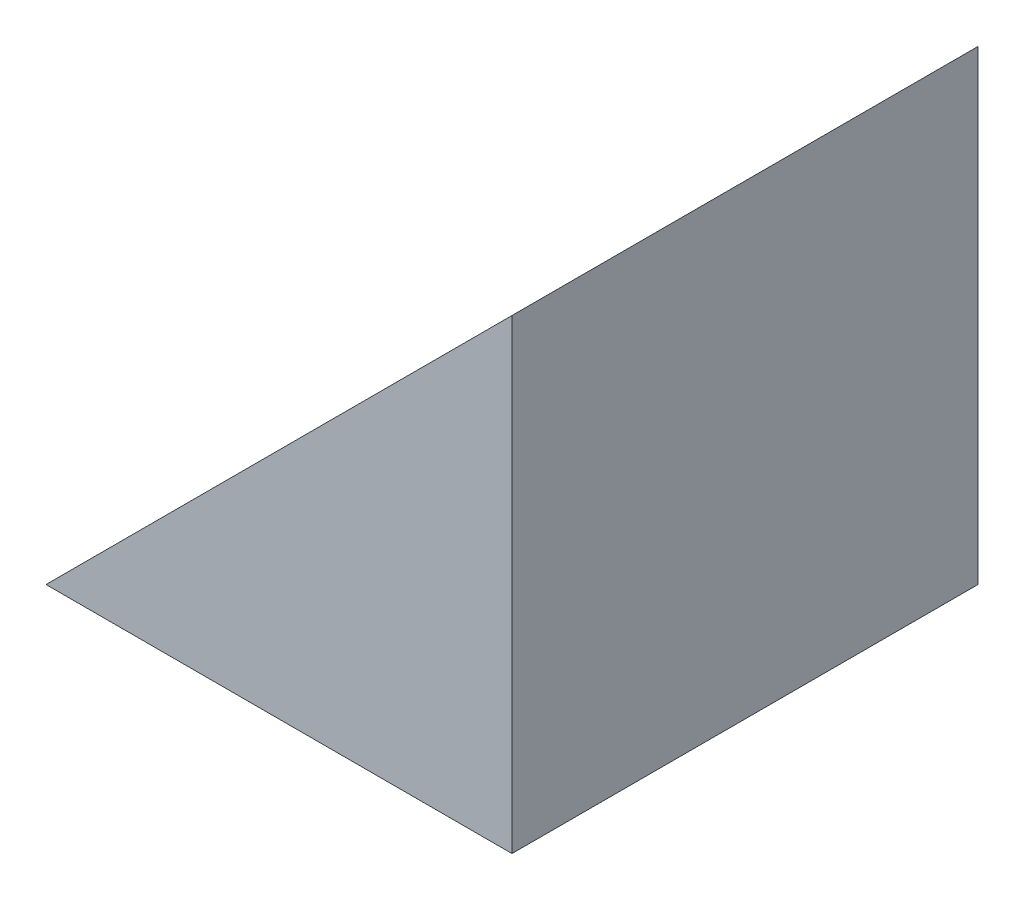
ISO-10303-21;
HEADER;
FILE_DESCRIPTION(('STEP AP214'),'2;1');
FILE_NAME('part.step','',(''),(''),'','','');
FILE_SCHEMA(('AUTOMOTIVE_DESIGN { 1 0 10303 214 1 1 1 1 }'));
ENDSEC;
DATA;
#1=APPLICATION_CONTEXT('core data for automotive mechanical design processes');
#2=APPLICATION_PROTOCOL_DEFINITION('international standard','automotive_design',2000,#1);
#3=PRODUCT_CONTEXT('',#1,'mechanical');
#4=PRODUCT('Part','Part','',(#3));
#5=PRODUCT_RELATED_PRODUCT_CATEGORY('part','',(#4));
#6=PRODUCT_DEFINITION_FORMATION('','',#4);
#7=PRODUCT_DEFINITION_CONTEXT('part definition',#1,'design');
#8=PRODUCT_DEFINITION('design','',#6,#7);
#9=PRODUCT_DEFINITION_SHAPE('','',#8);
#10=(LENGTH_UNIT() NAMED_UNIT(*) SI_UNIT(.MILLI.,.METRE.));
#11=(NAMED_UNIT(*) PLANE_ANGLE_UNIT() SI_UNIT($,.RADIAN.));
#12=(NAMED_UNIT(*) SI_UNIT($,.STERADIAN.) SOLID_ANGLE_UNIT());
#13=UNCERTAINTY_MEASURE_WITH_UNIT(LENGTH_MEASURE(1.E-05),#10,'distance_accuracy_value','');
#14=(GEOMETRIC_REPRESENTATION_CONTEXT(3) GLOBAL_UNCERTAINTY_ASSIGNED_CONTEXT((#13)) GLOBAL_UNIT_ASSIGNED_CONTEXT((#10,
#11,#12)) REPRESENTATION_CONTEXT('',''));
#15=CARTESIAN_POINT('',(0.,0.,0.));
#16=DIRECTION('',(0.,0.,1.));
#17=DIRECTION('',(1.,0.,0.));
#18=AXIS2_PLACEMENT_3D('',#15,#16,#17);
#19=CARTESIAN_POINT('',(17.4714063710906,13.2779070240306,5.));
#20=DIRECTION('',(0.,1.,0.));
#21=DIRECTION('',(0.,0.,1.));
#22=AXIS2_PLACEMENT_3D('',#19,#20,#21);
#23=PLANE('',#22);
#24=DIRECTION('',(1.,0.,0.));
#25=VECTOR('',#24,1.);
#26=CARTESIAN_POINT('',(17.4714063710906,13.2779070240306,0.));
#27=LINE('',#26,#25);
#28=CARTESIAN_POINT('',(12.4714063710906,13.2779070240306,0.));
#29=VERTEX_POINT('',#28);
#30=CARTESIAN_POINT('',(17.4714063710906,13.2779070240306,0.));
#31=VERTEX_POINT('',#30);
#32=EDGE_CURVE('E82',#29,#31,#27,.T.);
#33=ORIENTED_EDGE('',*,*,#32,.T.);
#34=DIRECTION('',(0.,0.,-1.));
#35=VECTOR('',#34,1.);
#36=CARTESIAN_POINT('',(17.4714063710906,13.2779070240306,5.));
#37=LINE('',#36,#35);
#38=CARTESIAN_POINT('',(17.4714063710906,13.2779070240306,5.));
#39=VERTEX_POINT('',#38);
#40=EDGE_CURVE('E11',#39,#31,#37,.T.);
#41=ORIENTED_EDGE('',*,*,#40,.F.);
#42=DIRECTION('',(1.,0.,0.));
#43=VECTOR('',#42,1.);
#44=CARTESIAN_POINT('',(17.4714063710906,13.2779070240306,5.));
#45=LINE('',#44,#43);
#46=CARTESIAN_POINT('',(12.4714063710906,13.2779070240306,5.));
#47=VERTEX_POINT('',#46);
#48=EDGE_CURVE('E75',#47,#39,#45,.T.);
#49=ORIENTED_EDGE('',*,*,#48,.F.);
#50=DIRECTION('',(0.,0.,-1.));
#51=VECTOR('',#50,1.);
#52=CARTESIAN_POINT('',(12.4714063710906,13.2779070240306,5.));
#53=LINE('',#52,#51);
#54=EDGE_CURVE('E83',#47,#29,#53,.T.);
#55=ORIENTED_EDGE('',*,*,#54,.T.);
#56=EDGE_LOOP('',(#33,#41,#49,#55));
#57=FACE_BOUND('',#56,.T.);
#58=ADVANCED_FACE('F35',(#57),#23,.F.);
#59=CARTESIAN_POINT('',(17.4714063710906,13.2779070240306,5.));
#60=DIRECTION('',(-1.,0.,0.));
#61=DIRECTION('',(0.,0.,1.));
#62=AXIS2_PLACEMENT_3D('',#59,#60,#61);
#63=PLANE('',#62);
#64=DIRECTION('',(0.,1.,0.));
#65=VECTOR('',#64,1.);
#66=CARTESIAN_POINT('',(17.4714063710906,13.2779070240306,0.));
#67=LINE('',#66,#65);
#68=CARTESIAN_POINT('',(17.4714063710906,18.2779070240306,0.));
#69=VERTEX_POINT('',#68);
#70=EDGE_CURVE('E63',#31,#69,#67,.T.);
#71=ORIENTED_EDGE('',*,*,#70,.T.);
#72=DIRECTION('',(0.,0.,-1.));
#73=VECTOR('',#72,1.);
#74=CARTESIAN_POINT('',(17.4714063710906,18.2779070240306,5.));
#75=LINE('',#74,#73);
#76=CARTESIAN_POINT('',(17.4714063710906,18.2779070240306,5.));
#77=VERTEX_POINT('',#76);
#78=EDGE_CURVE('E43',#77,#69,#75,.T.);
#79=ORIENTED_EDGE('',*,*,#78,.F.);
#80=DIRECTION('',(0.,1.,0.));
#81=VECTOR('',#80,1.);
#82=CARTESIAN_POINT('',(17.4714063710906,13.2779070240306,5.));
#83=LINE('',#82,#81);
#84=EDGE_CURVE('E71',#39,#77,#83,.T.);
#85=ORIENTED_EDGE('',*,*,#84,.F.);
#86=ORIENTED_EDGE('',*,*,#40,.T.);
#87=EDGE_LOOP('',(#71,#79,#85,#86));
#88=FACE_BOUND('',#87,.T.);
#89=ADVANCED_FACE('F72',(#88),#63,.F.);
#90=CARTESIAN_POINT('',(12.4714063710906,13.2779070240306,5.));
#91=DIRECTION('',(0.707106781186548,-0.707106781186548,0.));
#92=DIRECTION('',(0.707106781186548,0.707106781186548,0.));
#93=AXIS2_PLACEMENT_3D('',#90,#91,#92);
#94=PLANE('',#93);
#95=DIRECTION('',(-0.707106781186548,-0.707106781186548,0.));
#96=VECTOR('',#95,1.);
#97=CARTESIAN_POINT('',(12.4714063710906,13.2779070240306,0.));
#98=LINE('',#97,#96);
#99=EDGE_CURVE('E68',#69,#29,#98,.T.);
#100=ORIENTED_EDGE('',*,*,#99,.T.);
#101=ORIENTED_EDGE('',*,*,#54,.F.);
#102=DIRECTION('',(-0.707106781186548,-0.707106781186548,0.));
#103=VECTOR('',#102,1.);
#104=CARTESIAN_POINT('',(12.4714063710906,13.2779070240306,5.));
#105=LINE('',#104,#103);
#106=EDGE_CURVE('E51',#77,#47,#105,.T.);
#107=ORIENTED_EDGE('',*,*,#106,.F.);
#108=ORIENTED_EDGE('',*,*,#78,.T.);
#109=EDGE_LOOP('',(#100,#101,#107,#108));
#110=FACE_BOUND('',#109,.T.);
#111=ADVANCED_FACE('F90',(#110),#94,.F.);
#112=CARTESIAN_POINT('',(0.,0.,5.));
#113=DIRECTION('',(0.,0.,-1.));
#114=DIRECTION('',(-1.,0.,0.));
#115=AXIS2_PLACEMENT_3D('',#112,#113,#114);
#116=PLANE('',#115);
#117=ORIENTED_EDGE('',*,*,#48,.T.);
#118=ORIENTED_EDGE('',*,*,#84,.T.);
#119=ORIENTED_EDGE('',*,*,#106,.T.);
#120=EDGE_LOOP('',(#117,#118,#119));
#121=FACE_BOUND('',#120,.T.);
#122=ADVANCED_FACE('F78',(#121),#116,.F.);
#123=CARTESIAN_POINT('',(0.,0.,0.));
#124=DIRECTION('',(0.,0.,-1.));
#125=DIRECTION('',(-1.,0.,0.));
#126=AXIS2_PLACEMENT_3D('',#123,#124,#125);
#127=PLANE('',#126);
#128=ORIENTED_EDGE('',*,*,#32,.F.);
#129=ORIENTED_EDGE('',*,*,#99,.F.);
#130=ORIENTED_EDGE('',*,*,#70,.F.);
#131=EDGE_LOOP('',(#128,#129,#130));
#132=FACE_BOUND('',#131,.T.);
#133=ADVANCED_FACE('F91',(#132),#127,.T.);
#134=CLOSED_SHELL('',(#58,#89,#111,#122,#133));
#135=MANIFOLD_SOLID_BREP('B2',#134);
#136=ADVANCED_BREP_SHAPE_REPRESENTATION('',(#18,#135),#14);
#137=SHAPE_DEFINITION_REPRESENTATION(#9,#136);
ENDSEC;
END-ISO-10303-21;
